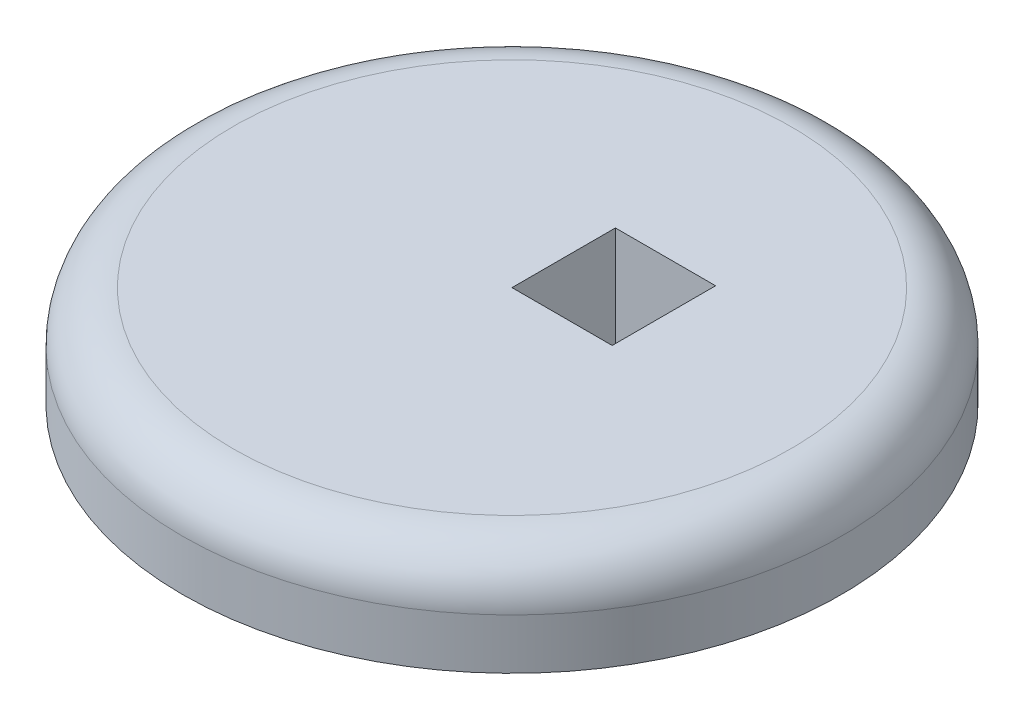
ISO-10303-21;
HEADER;
FILE_DESCRIPTION(('STEP AP214'),'2;1');
FILE_NAME('part.step','',(''),(''),'','','');
FILE_SCHEMA(('AUTOMOTIVE_DESIGN { 1 0 10303 214 1 1 1 1 }'));
ENDSEC;
DATA;
#1=APPLICATION_CONTEXT('core data for automotive mechanical design processes');
#2=APPLICATION_PROTOCOL_DEFINITION('international standard','automotive_design',2000,#1);
#3=PRODUCT_CONTEXT('',#1,'mechanical');
#4=PRODUCT('Part','Part','',(#3));
#5=PRODUCT_RELATED_PRODUCT_CATEGORY('part','',(#4));
#6=PRODUCT_DEFINITION_FORMATION('','',#4);
#7=PRODUCT_DEFINITION_CONTEXT('part definition',#1,'design');
#8=PRODUCT_DEFINITION('design','',#6,#7);
#9=PRODUCT_DEFINITION_SHAPE('','',#8);
#10=(LENGTH_UNIT() NAMED_UNIT(*) SI_UNIT(.MILLI.,.METRE.));
#11=(NAMED_UNIT(*) PLANE_ANGLE_UNIT() SI_UNIT($,.RADIAN.));
#12=(NAMED_UNIT(*) SI_UNIT($,.STERADIAN.) SOLID_ANGLE_UNIT());
#13=UNCERTAINTY_MEASURE_WITH_UNIT(LENGTH_MEASURE(1.E-05),#10,'distance_accuracy_value','');
#14=(GEOMETRIC_REPRESENTATION_CONTEXT(3) GLOBAL_UNCERTAINTY_ASSIGNED_CONTEXT((#13)) GLOBAL_UNIT_ASSIGNED_CONTEXT((#10,
#11,#12)) REPRESENTATION_CONTEXT('',''));
#15=CARTESIAN_POINT('',(0.,0.,0.));
#16=DIRECTION('',(0.,0.,1.));
#17=DIRECTION('',(1.,0.,0.));
#18=AXIS2_PLACEMENT_3D('',#15,#16,#17);
#19=CARTESIAN_POINT('',(0.,10.,0.));
#20=DIRECTION('',(0.,-1.,0.));
#21=DIRECTION('',(0.,0.,-1.));
#22=AXIS2_PLACEMENT_3D('',#19,#20,#21);
#23=CYLINDRICAL_SURFACE('',#22,32.625062453924);
#24=CARTESIAN_POINT('',(0.,5.,0.));
#25=DIRECTION('',(0.,1.,0.));
#26=DIRECTION('',(0.,0.,1.));
#27=AXIS2_PLACEMENT_3D('',#24,#25,#26);
#28=CIRCLE('',#27,32.625062453924);
#29=CARTESIAN_POINT('',(0.,5.,32.625062453924));
#30=VERTEX_POINT('',#29);
#31=EDGE_CURVE('E11',#30,#30,#28,.F.);
#32=ORIENTED_EDGE('',*,*,#31,.T.);
#33=EDGE_LOOP('',(#32));
#34=FACE_BOUND('',#33,.T.);
#35=CARTESIAN_POINT('',(0.,0.,0.));
#36=DIRECTION('',(0.,1.,0.));
#37=DIRECTION('',(0.,0.,1.));
#38=AXIS2_PLACEMENT_3D('',#35,#36,#37);
#39=CIRCLE('',#38,32.625062453924);
#40=CARTESIAN_POINT('',(0.,0.,32.625062453924));
#41=VERTEX_POINT('',#40);
#42=EDGE_CURVE('E111',#41,#41,#39,.T.);
#43=ORIENTED_EDGE('',*,*,#42,.T.);
#44=EDGE_LOOP('',(#43));
#45=FACE_BOUND('',#44,.T.);
#46=ADVANCED_FACE('F37',(#34,#45),#23,.T.);
#47=CARTESIAN_POINT('',(0.,10.,0.));
#48=DIRECTION('',(0.,1.,0.));
#49=DIRECTION('',(0.,0.,1.));
#50=AXIS2_PLACEMENT_3D('',#47,#48,#49);
#51=PLANE('',#50);
#52=DIRECTION('',(0.,0.,1.));
#53=VECTOR('',#52,1.);
#54=CARTESIAN_POINT('',(0.,10.,0.));
#55=LINE('',#54,#53);
#56=CARTESIAN_POINT('',(0.,10.,-10.2370198810152));
#57=VERTEX_POINT('',#56);
#58=CARTESIAN_POINT('',(0.,10.,0.));
#59=VERTEX_POINT('',#58);
#60=EDGE_CURVE('E52',#57,#59,#55,.T.);
#61=ORIENTED_EDGE('',*,*,#60,.F.);
#62=DIRECTION('',(-1.,0.,0.));
#63=VECTOR('',#62,1.);
#64=CARTESIAN_POINT('',(0.,10.,-10.2370198810152));
#65=LINE('',#64,#63);
#66=CARTESIAN_POINT('',(9.91853481805025,10.,-10.2370198810152));
#67=VERTEX_POINT('',#66);
#68=EDGE_CURVE('E96',#67,#57,#65,.T.);
#69=ORIENTED_EDGE('',*,*,#68,.F.);
#70=DIRECTION('',(0.,0.,-1.));
#71=VECTOR('',#70,1.);
#72=CARTESIAN_POINT('',(9.91853481805025,10.,0.));
#73=LINE('',#72,#71);
#74=CARTESIAN_POINT('',(9.91853481805025,10.,0.));
#75=VERTEX_POINT('',#74);
#76=EDGE_CURVE('E99',#75,#67,#73,.T.);
#77=ORIENTED_EDGE('',*,*,#76,.F.);
#78=DIRECTION('',(1.,0.,0.));
#79=VECTOR('',#78,1.);
#80=CARTESIAN_POINT('',(0.,10.,0.));
#81=LINE('',#80,#79);
#82=EDGE_CURVE('E105',#59,#75,#81,.T.);
#83=ORIENTED_EDGE('',*,*,#82,.F.);
#84=EDGE_LOOP('',(#61,#69,#77,#83));
#85=FACE_BOUND('',#84,.T.);
#86=CARTESIAN_POINT('',(0.,10.,0.));
#87=DIRECTION('',(0.,1.,0.));
#88=DIRECTION('',(0.,0.,1.));
#89=AXIS2_PLACEMENT_3D('',#86,#87,#88);
#90=CIRCLE('',#89,27.625062453924);
#91=CARTESIAN_POINT('',(0.,10.,27.625062453924));
#92=VERTEX_POINT('',#91);
#93=EDGE_CURVE('E45',#92,#92,#90,.T.);
#94=ORIENTED_EDGE('',*,*,#93,.T.);
#95=EDGE_LOOP('',(#94));
#96=FACE_BOUND('',#95,.T.);
#97=ADVANCED_FACE('F119',(#85,#96),#51,.T.);
#98=CARTESIAN_POINT('',(0.,0.,0.));
#99=DIRECTION('',(0.,1.,0.));
#100=DIRECTION('',(0.,0.,1.));
#101=AXIS2_PLACEMENT_3D('',#98,#99,#100);
#102=PLANE('',#101);
#103=DIRECTION('',(-1.,0.,0.));
#104=VECTOR('',#103,1.);
#105=CARTESIAN_POINT('',(0.,0.,-10.2370198810152));
#106=LINE('',#105,#104);
#107=CARTESIAN_POINT('',(9.91853481805025,0.,-10.2370198810152));
#108=VERTEX_POINT('',#107);
#109=CARTESIAN_POINT('',(0.,0.,-10.2370198810152));
#110=VERTEX_POINT('',#109);
#111=EDGE_CURVE('E86',#108,#110,#106,.T.);
#112=ORIENTED_EDGE('',*,*,#111,.T.);
#113=DIRECTION('',(0.,0.,1.));
#114=VECTOR('',#113,1.);
#115=CARTESIAN_POINT('',(0.,0.,0.));
#116=LINE('',#115,#114);
#117=CARTESIAN_POINT('',(0.,0.,0.));
#118=VERTEX_POINT('',#117);
#119=EDGE_CURVE('E80',#110,#118,#116,.T.);
#120=ORIENTED_EDGE('',*,*,#119,.T.);
#121=DIRECTION('',(1.,0.,0.));
#122=VECTOR('',#121,1.);
#123=CARTESIAN_POINT('',(0.,0.,0.));
#124=LINE('',#123,#122);
#125=CARTESIAN_POINT('',(9.91853481805025,0.,0.));
#126=VERTEX_POINT('',#125);
#127=EDGE_CURVE('E89',#118,#126,#124,.T.);
#128=ORIENTED_EDGE('',*,*,#127,.T.);
#129=DIRECTION('',(0.,0.,-1.));
#130=VECTOR('',#129,1.);
#131=CARTESIAN_POINT('',(9.91853481805025,0.,0.));
#132=LINE('',#131,#130);
#133=EDGE_CURVE('E60',#126,#108,#132,.T.);
#134=ORIENTED_EDGE('',*,*,#133,.T.);
#135=EDGE_LOOP('',(#112,#120,#128,#134));
#136=FACE_BOUND('',#135,.T.);
#137=ORIENTED_EDGE('',*,*,#42,.F.);
#138=EDGE_LOOP('',(#137));
#139=FACE_BOUND('',#138,.T.);
#140=ADVANCED_FACE('F93',(#136,#139),#102,.F.);
#141=CARTESIAN_POINT('',(0.,5.,0.));
#142=DIRECTION('',(0.,1.,0.));
#143=DIRECTION('',(0.,0.,1.));
#144=AXIS2_PLACEMENT_3D('',#141,#142,#143);
#145=TOROIDAL_SURFACE('',#144,27.625062453924,5.);
#146=ORIENTED_EDGE('',*,*,#31,.F.);
#147=EDGE_LOOP('',(#146));
#148=FACE_BOUND('',#147,.T.);
#149=ORIENTED_EDGE('',*,*,#93,.F.);
#150=EDGE_LOOP('',(#149));
#151=FACE_BOUND('',#150,.T.);
#152=ADVANCED_FACE('F39',(#148,#151),#145,.T.);
#153=CARTESIAN_POINT('',(0.,0.,0.));
#154=DIRECTION('',(-1.,0.,0.));
#155=DIRECTION('',(0.,0.,1.));
#156=AXIS2_PLACEMENT_3D('',#153,#154,#155);
#157=PLANE('',#156);
#158=ORIENTED_EDGE('',*,*,#60,.T.);
#159=DIRECTION('',(0.,1.,0.));
#160=VECTOR('',#159,1.);
#161=CARTESIAN_POINT('',(0.,0.,0.));
#162=LINE('',#161,#160);
#163=EDGE_CURVE('E76',#118,#59,#162,.T.);
#164=ORIENTED_EDGE('',*,*,#163,.F.);
#165=ORIENTED_EDGE('',*,*,#119,.F.);
#166=DIRECTION('',(0.,1.,0.));
#167=VECTOR('',#166,1.);
#168=CARTESIAN_POINT('',(0.,0.,-10.2370198810152));
#169=LINE('',#168,#167);
#170=EDGE_CURVE('E109',#110,#57,#169,.T.);
#171=ORIENTED_EDGE('',*,*,#170,.T.);
#172=EDGE_LOOP('',(#158,#164,#165,#171));
#173=FACE_BOUND('',#172,.T.);
#174=ADVANCED_FACE('F78',(#173),#157,.F.);
#175=CARTESIAN_POINT('',(0.,0.,-10.2370198810152));
#176=DIRECTION('',(0.,0.,-1.));
#177=DIRECTION('',(-1.,0.,0.));
#178=AXIS2_PLACEMENT_3D('',#175,#176,#177);
#179=PLANE('',#178);
#180=ORIENTED_EDGE('',*,*,#68,.T.);
#181=ORIENTED_EDGE('',*,*,#170,.F.);
#182=ORIENTED_EDGE('',*,*,#111,.F.);
#183=DIRECTION('',(0.,1.,0.));
#184=VECTOR('',#183,1.);
#185=CARTESIAN_POINT('',(9.91853481805025,0.,-10.2370198810152));
#186=LINE('',#185,#184);
#187=EDGE_CURVE('E112',#108,#67,#186,.T.);
#188=ORIENTED_EDGE('',*,*,#187,.T.);
#189=EDGE_LOOP('',(#180,#181,#182,#188));
#190=FACE_BOUND('',#189,.T.);
#191=ADVANCED_FACE('F127',(#190),#179,.F.);
#192=CARTESIAN_POINT('',(9.91853481805025,0.,0.));
#193=DIRECTION('',(1.,0.,0.));
#194=DIRECTION('',(0.,0.,-1.));
#195=AXIS2_PLACEMENT_3D('',#192,#193,#194);
#196=PLANE('',#195);
#197=ORIENTED_EDGE('',*,*,#76,.T.);
#198=ORIENTED_EDGE('',*,*,#187,.F.);
#199=ORIENTED_EDGE('',*,*,#133,.F.);
#200=DIRECTION('',(0.,1.,0.));
#201=VECTOR('',#200,1.);
#202=CARTESIAN_POINT('',(9.91853481805025,0.,0.));
#203=LINE('',#202,#201);
#204=EDGE_CURVE('E85',#126,#75,#203,.T.);
#205=ORIENTED_EDGE('',*,*,#204,.T.);
#206=EDGE_LOOP('',(#197,#198,#199,#205));
#207=FACE_BOUND('',#206,.T.);
#208=ADVANCED_FACE('F142',(#207),#196,.F.);
#209=CARTESIAN_POINT('',(0.,0.,0.));
#210=DIRECTION('',(0.,0.,1.));
#211=DIRECTION('',(1.,0.,0.));
#212=AXIS2_PLACEMENT_3D('',#209,#210,#211);
#213=PLANE('',#212);
#214=ORIENTED_EDGE('',*,*,#82,.T.);
#215=ORIENTED_EDGE('',*,*,#204,.F.);
#216=ORIENTED_EDGE('',*,*,#127,.F.);
#217=ORIENTED_EDGE('',*,*,#163,.T.);
#218=EDGE_LOOP('',(#214,#215,#216,#217));
#219=FACE_BOUND('',#218,.T.);
#220=ADVANCED_FACE('F90',(#219),#213,.F.);
#221=CLOSED_SHELL('',(#46,#97,#140,#152,#174,#191,#208,#220));
#222=MANIFOLD_SOLID_BREP('B2',#221);
#223=ADVANCED_BREP_SHAPE_REPRESENTATION('',(#18,#222),#14);
#224=SHAPE_DEFINITION_REPRESENTATION(#9,#223);
ENDSEC;
END-ISO-10303-21;
